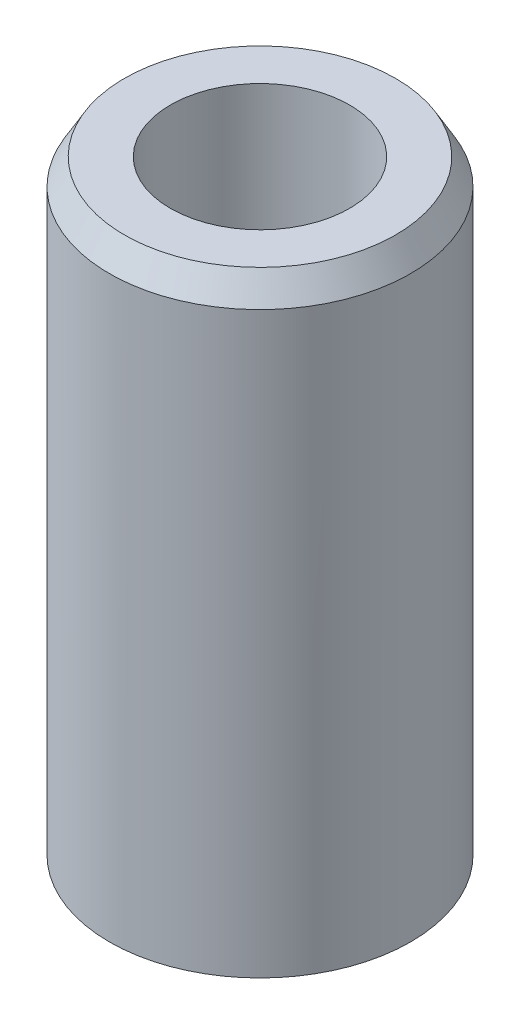
ISO-10303-21;
HEADER;
FILE_DESCRIPTION(('STEP AP214'),'2;1');
FILE_NAME('part.step','',(''),(''),'','','');
FILE_SCHEMA(('AUTOMOTIVE_DESIGN { 1 0 10303 214 1 1 1 1 }'));
ENDSEC;
DATA;
#1=APPLICATION_CONTEXT('core data for automotive mechanical design processes');
#2=APPLICATION_PROTOCOL_DEFINITION('international standard','automotive_design',2000,#1);
#3=PRODUCT_CONTEXT('',#1,'mechanical');
#4=PRODUCT('Part','Part','',(#3));
#5=PRODUCT_RELATED_PRODUCT_CATEGORY('part','',(#4));
#6=PRODUCT_DEFINITION_FORMATION('','',#4);
#7=PRODUCT_DEFINITION_CONTEXT('part definition',#1,'design');
#8=PRODUCT_DEFINITION('design','',#6,#7);
#9=PRODUCT_DEFINITION_SHAPE('','',#8);
#10=(LENGTH_UNIT() NAMED_UNIT(*) SI_UNIT(.MILLI.,.METRE.));
#11=(NAMED_UNIT(*) PLANE_ANGLE_UNIT() SI_UNIT($,.RADIAN.));
#12=(NAMED_UNIT(*) SI_UNIT($,.STERADIAN.) SOLID_ANGLE_UNIT());
#13=UNCERTAINTY_MEASURE_WITH_UNIT(LENGTH_MEASURE(1.E-05),#10,'distance_accuracy_value','');
#14=(GEOMETRIC_REPRESENTATION_CONTEXT(3) GLOBAL_UNCERTAINTY_ASSIGNED_CONTEXT((#13)) GLOBAL_UNIT_ASSIGNED_CONTEXT((#10,
#11,#12)) REPRESENTATION_CONTEXT('',''));
#15=CARTESIAN_POINT('',(0.,0.,0.));
#16=DIRECTION('',(0.,0.,1.));
#17=DIRECTION('',(1.,0.,0.));
#18=AXIS2_PLACEMENT_3D('',#15,#16,#17);
#19=CARTESIAN_POINT('',(0.,92.5887020346337,0.));
#20=DIRECTION('',(0.,-1.,0.));
#21=DIRECTION('',(0.,0.,-1.));
#22=AXIS2_PLACEMENT_3D('',#19,#20,#21);
#23=CYLINDRICAL_SURFACE('',#22,22.5);
#24=CARTESIAN_POINT('',(0.,88.7079291125816,0.));
#25=DIRECTION('',(0.,1.,0.));
#26=DIRECTION('',(0.,0.,1.));
#27=AXIS2_PLACEMENT_3D('',#24,#25,#26);
#28=CIRCLE('',#27,22.5);
#29=CARTESIAN_POINT('',(0.,88.7079291125816,-22.5));
#30=VERTEX_POINT('',#29);
#31=EDGE_CURVE('E50',#30,#30,#28,.F.);
#32=ORIENTED_EDGE('',*,*,#31,.T.);
#33=EDGE_LOOP('',(#32));
#34=FACE_BOUND('',#33,.T.);
#35=CARTESIAN_POINT('',(0.,2.2405652912105,0.));
#36=DIRECTION('',(0.,1.,0.));
#37=DIRECTION('',(0.,0.,1.));
#38=AXIS2_PLACEMENT_3D('',#35,#36,#37);
#39=CIRCLE('',#38,22.5);
#40=CARTESIAN_POINT('',(0.,2.2405652912105,22.5));
#41=VERTEX_POINT('',#40);
#42=EDGE_CURVE('E51',#41,#41,#39,.T.);
#43=ORIENTED_EDGE('',*,*,#42,.T.);
#44=EDGE_LOOP('',(#43));
#45=FACE_BOUND('',#44,.T.);
#46=ADVANCED_FACE('F39',(#34,#45),#23,.T.);
#47=CARTESIAN_POINT('',(0.,92.5887020346337,0.));
#48=DIRECTION('',(0.,1.,0.));
#49=DIRECTION('',(0.,0.,1.));
#50=AXIS2_PLACEMENT_3D('',#47,#48,#49);
#51=PLANE('',#50);
#52=CARTESIAN_POINT('',(0.,92.5887020346337,0.));
#53=DIRECTION('',(0.,1.,0.));
#54=DIRECTION('',(0.,0.,1.));
#55=AXIS2_PLACEMENT_3D('',#52,#53,#54);
#56=CIRCLE('',#55,20.2594347087895);
#57=CARTESIAN_POINT('',(0.,92.5887020346337,-20.2594347087895));
#58=VERTEX_POINT('',#57);
#59=EDGE_CURVE('E54',#58,#58,#56,.T.);
#60=ORIENTED_EDGE('',*,*,#59,.T.);
#61=EDGE_LOOP('',(#60));
#62=FACE_BOUND('',#61,.T.);
#63=CARTESIAN_POINT('',(0.,92.5887020346337,0.));
#64=DIRECTION('',(0.,1.,0.));
#65=DIRECTION('',(0.,0.,1.));
#66=AXIS2_PLACEMENT_3D('',#63,#64,#65);
#67=CIRCLE('',#66,13.3878134072473);
#68=CARTESIAN_POINT('',(0.,92.5887020346337,13.3878134072473));
#69=VERTEX_POINT('',#68);
#70=EDGE_CURVE('E58',#69,#69,#67,.T.);
#71=ORIENTED_EDGE('',*,*,#70,.F.);
#72=EDGE_LOOP('',(#71));
#73=FACE_BOUND('',#72,.T.);
#74=ADVANCED_FACE('F69',(#62,#73),#51,.T.);
#75=CARTESIAN_POINT('',(0.,0.,0.));
#76=DIRECTION('',(0.,1.,0.));
#77=DIRECTION('',(0.,0.,1.));
#78=AXIS2_PLACEMENT_3D('',#75,#76,#77);
#79=PLANE('',#78);
#80=CARTESIAN_POINT('',(0.,0.,0.));
#81=DIRECTION('',(0.,1.,0.));
#82=DIRECTION('',(0.,0.,1.));
#83=AXIS2_PLACEMENT_3D('',#80,#81,#82);
#84=CIRCLE('',#83,18.619227077948);
#85=CARTESIAN_POINT('',(0.,0.,18.619227077948));
#86=VERTEX_POINT('',#85);
#87=EDGE_CURVE('E10',#86,#86,#84,.F.);
#88=ORIENTED_EDGE('',*,*,#87,.T.);
#89=EDGE_LOOP('',(#88));
#90=FACE_BOUND('',#89,.T.);
#91=CARTESIAN_POINT('',(0.,0.,0.));
#92=DIRECTION('',(0.,1.,0.));
#93=DIRECTION('',(0.,0.,1.));
#94=AXIS2_PLACEMENT_3D('',#91,#92,#93);
#95=CIRCLE('',#94,13.3878134072473);
#96=CARTESIAN_POINT('',(0.,0.,13.3878134072473));
#97=VERTEX_POINT('',#96);
#98=EDGE_CURVE('E63',#97,#97,#95,.T.);
#99=ORIENTED_EDGE('',*,*,#98,.T.);
#100=EDGE_LOOP('',(#99));
#101=FACE_BOUND('',#100,.T.);
#102=ADVANCED_FACE('F75',(#90,#101),#79,.F.);
#103=CARTESIAN_POINT('',(0.,92.5887020346337,0.));
#104=DIRECTION('',(0.,-1.,0.));
#105=DIRECTION('',(0.,0.,-1.));
#106=AXIS2_PLACEMENT_3D('',#103,#104,#105);
#107=CYLINDRICAL_SURFACE('',#106,13.3878134072473);
#108=ORIENTED_EDGE('',*,*,#70,.T.);
#109=EDGE_LOOP('',(#108));
#110=FACE_BOUND('',#109,.T.);
#111=ORIENTED_EDGE('',*,*,#98,.F.);
#112=EDGE_LOOP('',(#111));
#113=FACE_BOUND('',#112,.T.);
#114=ADVANCED_FACE('F70',(#110,#113),#107,.F.);
#115=CARTESIAN_POINT('',(0.,92.5887020346337,0.));
#116=DIRECTION('',(0.,-1.,0.));
#117=DIRECTION('',(0.,0.,-1.));
#118=AXIS2_PLACEMENT_3D('',#115,#116,#117);
#119=CONICAL_SURFACE('',#118,20.2594347087895,0.523598775598296);
#120=CARTESIAN_POINT('',(0.,88.7079291125816,-22.5));
#121=CARTESIAN_POINT('',(0.,88.7483538305197,-22.4766607782166));
#122=CARTESIAN_POINT('',(0.,88.7887785484577,-22.4533215564331));
#123=CARTESIAN_POINT('',(0.,88.8696279843338,-22.4066431128662));
#124=CARTESIAN_POINT('',(0.,88.9100527022719,-22.3833038910828));
#125=CARTESIAN_POINT('',(0.,88.9909021381479,-22.3366254475159));
#126=CARTESIAN_POINT('',(0.,89.031326856086,-22.3132862257325));
#127=CARTESIAN_POINT('',(0.,89.1121762919621,-22.2666077821656));
#128=CARTESIAN_POINT('',(0.,89.1526010099001,-22.2432685603821));
#129=CARTESIAN_POINT('',(0.,89.2334504457762,-22.1965901168152));
#130=CARTESIAN_POINT('',(0.,89.2738751637142,-22.1732508950318));
#131=CARTESIAN_POINT('',(0.,89.3547245995903,-22.1265724514649));
#132=CARTESIAN_POINT('',(0.,89.3951493175284,-22.1032332296815));
#133=CARTESIAN_POINT('',(0.,89.4759987534044,-22.0565547861146));
#134=CARTESIAN_POINT('',(0.,89.5164234713425,-22.0332155643311));
#135=CARTESIAN_POINT('',(0.,89.5972729072186,-21.9865371207643));
#136=CARTESIAN_POINT('',(0.,89.6376976251566,-21.9631978989808));
#137=CARTESIAN_POINT('',(0.,89.7185470610327,-21.9165194554139));
#138=CARTESIAN_POINT('',(0.,89.7589717789707,-21.8931802336305));
#139=CARTESIAN_POINT('',(0.,89.8398212148468,-21.8465017900636));
#140=CARTESIAN_POINT('',(0.,89.8802459327849,-21.8231625682802));
#141=CARTESIAN_POINT('',(0.,89.9610953686609,-21.7764841247133));
#142=CARTESIAN_POINT('',(0.,90.001520086599,-21.7531449029298));
#143=CARTESIAN_POINT('',(0.,90.0823695224751,-21.7064664593629));
#144=CARTESIAN_POINT('',(0.,90.1227942404131,-21.6831272375795));
#145=CARTESIAN_POINT('',(0.,90.2036436762892,-21.6364487940126));
#146=CARTESIAN_POINT('',(0.,90.2440683942272,-21.6131095722292));
#147=CARTESIAN_POINT('',(0.,90.3249178301033,-21.5664311286623));
#148=CARTESIAN_POINT('',(0.,90.3653425480414,-21.5430919068788));
#149=CARTESIAN_POINT('',(0.,90.4461919839174,-21.496413463312));
#150=CARTESIAN_POINT('',(0.,90.4866167018555,-21.4730742415285));
#151=CARTESIAN_POINT('',(0.,90.5674661377316,-21.4263957979616));
#152=CARTESIAN_POINT('',(0.,90.6078908556696,-21.4030565761782));
#153=CARTESIAN_POINT('',(0.,90.6887402915457,-21.3563781326113));
#154=CARTESIAN_POINT('',(0.,90.7291650094837,-21.3330389108279));
#155=CARTESIAN_POINT('',(0.,90.8100144453598,-21.286360467261));
#156=CARTESIAN_POINT('',(0.,90.8504391632979,-21.2630212454775));
#157=CARTESIAN_POINT('',(0.,90.9312885991739,-21.2163428019106));
#158=CARTESIAN_POINT('',(0.,90.971713317112,-21.1930035801272));
#159=CARTESIAN_POINT('',(0.,91.0525627529881,-21.1463251365603));
#160=CARTESIAN_POINT('',(0.,91.0929874709261,-21.1229859147769));
#161=CARTESIAN_POINT('',(0.,91.1738369068022,-21.07630747121));
#162=CARTESIAN_POINT('',(0.,91.2142616247402,-21.0529682494265));
#163=CARTESIAN_POINT('',(0.,91.2951110606163,-21.0062898058597));
#164=CARTESIAN_POINT('',(0.,91.3355357785544,-20.9829505840762));
#165=CARTESIAN_POINT('',(0.,91.4163852144304,-20.9362721405093));
#166=CARTESIAN_POINT('',(0.,91.4568099323685,-20.9129329187259));
#167=CARTESIAN_POINT('',(0.,91.5376593682446,-20.866254475159));
#168=CARTESIAN_POINT('',(0.,91.5780840861826,-20.8429152533756));
#169=CARTESIAN_POINT('',(0.,91.6589335220587,-20.7962368098087));
#170=CARTESIAN_POINT('',(0.,91.6993582399967,-20.7728975880252));
#171=CARTESIAN_POINT('',(0.,91.7802076758728,-20.7262191444583));
#172=CARTESIAN_POINT('',(0.,91.8206323938109,-20.7028799226749));
#173=CARTESIAN_POINT('',(0.,91.901481829687,-20.656201479108));
#174=CARTESIAN_POINT('',(0.,91.941906547625,-20.6328622573246));
#175=CARTESIAN_POINT('',(0.,92.0227559835011,-20.5861838137577));
#176=CARTESIAN_POINT('',(0.,92.0631807014391,-20.5628445919742));
#177=CARTESIAN_POINT('',(0.,92.1440301373152,-20.5161661484073));
#178=CARTESIAN_POINT('',(0.,92.1844548552532,-20.4928269266239));
#179=CARTESIAN_POINT('',(0.,92.2653042911293,-20.446148483057));
#180=CARTESIAN_POINT('',(0.,92.3057290090674,-20.4228092612736));
#181=CARTESIAN_POINT('',(0.,92.3865784449435,-20.3761308177067));
#182=CARTESIAN_POINT('',(0.,92.4270031628815,-20.3527915959232));
#183=CARTESIAN_POINT('',(0.,92.5078525987576,-20.3061131523564));
#184=CARTESIAN_POINT('',(0.,92.5482773166956,-20.2827739305729));
#185=CARTESIAN_POINT('',(0.,92.5887020346337,-20.2594347087895));
#186=B_SPLINE_CURVE_WITH_KNOTS('',3,(#120,#121,#122,#123,#124,#125,#126,#127,#128,#129,#130,
#131,#132,#133,#134,#135,#136,#137,#138,#139,#140,#141,#142,#143,#144,#145,#146,#147,#148,#149,
#150,#151,#152,#153,#154,#155,#156,#157,#158,#159,#160,#161,#162,#163,#164,#165,#166,#167,#168,
#169,#170,#171,#172,#173,#174,#175,#176,#177,#178,#179,#180,#181,#182,#183,#184,#185),
.UNSPECIFIED.,.F.,.F.,(4,2,2,2,2,2,2,2,2,2,2,2,2,2,2,2,2,2,2,2,2,2,2,2,2,2,2,2,2,2,2,2,4),(0.,
0.140035330700653,0.280070661401318,0.420105992101971,0.560141322802635,0.700176653503288,
0.840211984203953,0.980247314904606,1.12028264560527,1.26031797630592,1.40035330700659,
1.54038863770724,1.68042396840791,1.82045929910856,1.96049462980922,2.10052996050988,
2.24056529121054,2.38060062191119,2.52063595261186,2.66067128331251,2.80070661401318,
2.94074194471383,3.0807772754145,3.22081260611515,3.36084793681581,3.50088326751647,
3.64091859821713,3.78095392891778,3.92098925961845,4.0610245903191,4.20105992101977,
4.34109525172042,4.48113058242108),.UNSPECIFIED.);
#187=EDGE_CURVE('BSEAM81',#30,#58,#186,.T.);
#188=ORIENTED_EDGE('',*,*,#31,.F.);
#189=ORIENTED_EDGE('',*,*,#59,.F.);
#190=ORIENTED_EDGE('',*,*,#187,.T.);
#191=ORIENTED_EDGE('',*,*,#187,.F.);
#192=EDGE_LOOP('',(#188,#190,#189,#191));
#193=FACE_BOUND('',#192,.T.);
#194=ADVANCED_FACE('F81',(#193),#119,.T.);
#195=CARTESIAN_POINT('',(0.,2.2405652912105,0.));
#196=DIRECTION('',(0.,1.,0.));
#197=DIRECTION('',(0.,0.,1.));
#198=AXIS2_PLACEMENT_3D('',#195,#196,#197);
#199=CONICAL_SURFACE('',#198,22.5,1.0471975511966);
#200=ORIENTED_EDGE('',*,*,#87,.F.);
#201=EDGE_LOOP('',(#200));
#202=FACE_BOUND('',#201,.T.);
#203=ORIENTED_EDGE('',*,*,#42,.F.);
#204=EDGE_LOOP('',(#203));
#205=FACE_BOUND('',#204,.T.);
#206=ADVANCED_FACE('F45',(#202,#205),#199,.T.);
#207=CLOSED_SHELL('',(#46,#74,#102,#114,#194,#206));
#208=MANIFOLD_SOLID_BREP('B2',#207);
#209=ADVANCED_BREP_SHAPE_REPRESENTATION('',(#18,#208),#14);
#210=SHAPE_DEFINITION_REPRESENTATION(#9,#209);
ENDSEC;
END-ISO-10303-21;
